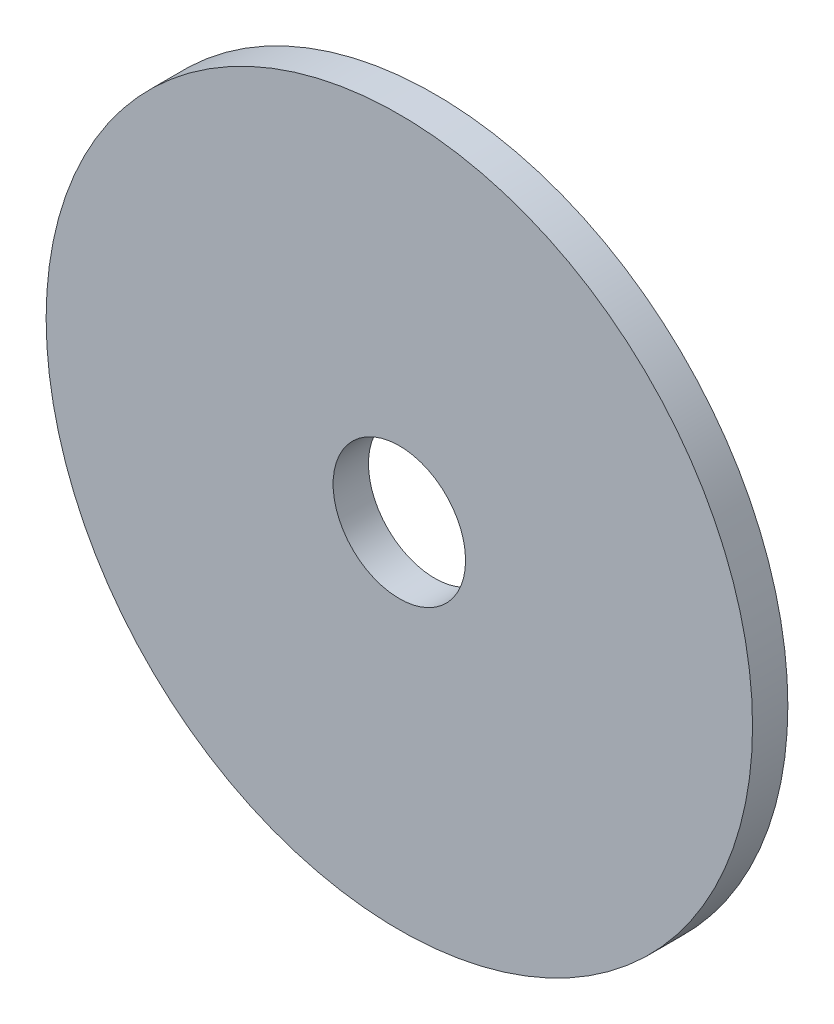
ISO-10303-21;
HEADER;
FILE_DESCRIPTION(('STEP AP214'),'2;1');
FILE_NAME('part.step','',(''),(''),'','','');
FILE_SCHEMA(('AUTOMOTIVE_DESIGN { 1 0 10303 214 1 1 1 1 }'));
ENDSEC;
DATA;
#1=APPLICATION_CONTEXT('core data for automotive mechanical design processes');
#2=APPLICATION_PROTOCOL_DEFINITION('international standard','automotive_design',2000,#1);
#3=PRODUCT_CONTEXT('',#1,'mechanical');
#4=PRODUCT('Part','Part','',(#3));
#5=PRODUCT_RELATED_PRODUCT_CATEGORY('part','',(#4));
#6=PRODUCT_DEFINITION_FORMATION('','',#4);
#7=PRODUCT_DEFINITION_CONTEXT('part definition',#1,'design');
#8=PRODUCT_DEFINITION('design','',#6,#7);
#9=PRODUCT_DEFINITION_SHAPE('','',#8);
#10=(LENGTH_UNIT() NAMED_UNIT(*) SI_UNIT(.MILLI.,.METRE.));
#11=(NAMED_UNIT(*) PLANE_ANGLE_UNIT() SI_UNIT($,.RADIAN.));
#12=(NAMED_UNIT(*) SI_UNIT($,.STERADIAN.) SOLID_ANGLE_UNIT());
#13=UNCERTAINTY_MEASURE_WITH_UNIT(LENGTH_MEASURE(1.E-05),#10,'distance_accuracy_value','');
#14=(GEOMETRIC_REPRESENTATION_CONTEXT(3) GLOBAL_UNCERTAINTY_ASSIGNED_CONTEXT((#13)) GLOBAL_UNIT_ASSIGNED_CONTEXT((#10,
#11,#12)) REPRESENTATION_CONTEXT('',''));
#15=CARTESIAN_POINT('',(0.,0.,0.));
#16=DIRECTION('',(0.,0.,1.));
#17=DIRECTION('',(1.,0.,0.));
#18=AXIS2_PLACEMENT_3D('',#15,#16,#17);
#19=CARTESIAN_POINT('',(0.,0.,1.27));
#20=DIRECTION('',(0.,0.,1.));
#21=DIRECTION('',(1.,0.,0.));
#22=AXIS2_PLACEMENT_3D('',#19,#20,#21);
#23=PLANE('',#22);
#24=CARTESIAN_POINT('',(0.,0.,1.27));
#25=DIRECTION('',(0.,0.,1.));
#26=DIRECTION('',(1.,0.,0.));
#27=AXIS2_PLACEMENT_3D('',#24,#25,#26);
#28=CIRCLE('',#27,12.7);
#29=CARTESIAN_POINT('',(12.7,0.,1.27));
#30=VERTEX_POINT('',#29);
#31=EDGE_CURVE('E10',#30,#30,#28,.T.);
#32=ORIENTED_EDGE('',*,*,#31,.T.);
#33=EDGE_LOOP('',(#32));
#34=FACE_BOUND('',#33,.T.);
#35=CARTESIAN_POINT('',(0.,0.,1.27));
#36=DIRECTION('',(0.,0.,1.));
#37=DIRECTION('',(1.,0.,0.));
#38=AXIS2_PLACEMENT_3D('',#35,#36,#37);
#39=CIRCLE('',#38,2.38125);
#40=CARTESIAN_POINT('',(2.38125,0.,1.27));
#41=VERTEX_POINT('',#40);
#42=EDGE_CURVE('E42',#41,#41,#39,.T.);
#43=ORIENTED_EDGE('',*,*,#42,.F.);
#44=EDGE_LOOP('',(#43));
#45=FACE_BOUND('',#44,.T.);
#46=ADVANCED_FACE('F31',(#34,#45),#23,.T.);
#47=CARTESIAN_POINT('',(0.,0.,0.));
#48=DIRECTION('',(0.,0.,1.));
#49=DIRECTION('',(1.,0.,0.));
#50=AXIS2_PLACEMENT_3D('',#47,#48,#49);
#51=PLANE('',#50);
#52=CARTESIAN_POINT('',(0.,0.,0.));
#53=DIRECTION('',(0.,0.,1.));
#54=DIRECTION('',(1.,0.,0.));
#55=AXIS2_PLACEMENT_3D('',#52,#53,#54);
#56=CIRCLE('',#55,12.7);
#57=CARTESIAN_POINT('',(12.7,0.,0.));
#58=VERTEX_POINT('',#57);
#59=EDGE_CURVE('E35',#58,#58,#56,.T.);
#60=ORIENTED_EDGE('',*,*,#59,.F.);
#61=EDGE_LOOP('',(#60));
#62=FACE_BOUND('',#61,.T.);
#63=CARTESIAN_POINT('',(0.,0.,0.));
#64=DIRECTION('',(0.,0.,1.));
#65=DIRECTION('',(1.,0.,0.));
#66=AXIS2_PLACEMENT_3D('',#63,#64,#65);
#67=CIRCLE('',#66,2.38125);
#68=CARTESIAN_POINT('',(2.38125,0.,0.));
#69=VERTEX_POINT('',#68);
#70=EDGE_CURVE('E44',#69,#69,#67,.T.);
#71=ORIENTED_EDGE('',*,*,#70,.T.);
#72=EDGE_LOOP('',(#71));
#73=FACE_BOUND('',#72,.T.);
#74=ADVANCED_FACE('F54',(#62,#73),#51,.F.);
#75=CARTESIAN_POINT('',(0.,0.,1.27));
#76=DIRECTION('',(0.,0.,-1.));
#77=DIRECTION('',(-1.,0.,0.));
#78=AXIS2_PLACEMENT_3D('',#75,#76,#77);
#79=CYLINDRICAL_SURFACE('',#78,12.7);
#80=ORIENTED_EDGE('',*,*,#31,.F.);
#81=EDGE_LOOP('',(#80));
#82=FACE_BOUND('',#81,.T.);
#83=ORIENTED_EDGE('',*,*,#59,.T.);
#84=EDGE_LOOP('',(#83));
#85=FACE_BOUND('',#84,.T.);
#86=ADVANCED_FACE('F33',(#82,#85),#79,.T.);
#87=CARTESIAN_POINT('',(0.,0.,1.27));
#88=DIRECTION('',(0.,0.,-1.));
#89=DIRECTION('',(-1.,0.,0.));
#90=AXIS2_PLACEMENT_3D('',#87,#88,#89);
#91=CYLINDRICAL_SURFACE('',#90,2.38125);
#92=ORIENTED_EDGE('',*,*,#42,.T.);
#93=EDGE_LOOP('',(#92));
#94=FACE_BOUND('',#93,.T.);
#95=ORIENTED_EDGE('',*,*,#70,.F.);
#96=EDGE_LOOP('',(#95));
#97=FACE_BOUND('',#96,.T.);
#98=ADVANCED_FACE('F50',(#94,#97),#91,.F.);
#99=CLOSED_SHELL('',(#46,#74,#86,#98));
#100=MANIFOLD_SOLID_BREP('B2',#99);
#101=ADVANCED_BREP_SHAPE_REPRESENTATION('',(#18,#100),#14);
#102=SHAPE_DEFINITION_REPRESENTATION(#9,#101);
ENDSEC;
END-ISO-10303-21;
